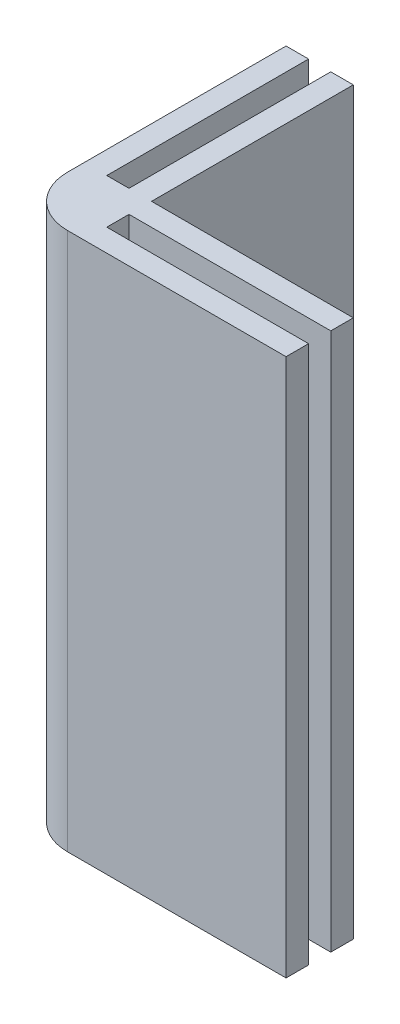
ISO-10303-21;
HEADER;
FILE_DESCRIPTION(('STEP AP214'),'2;1');
FILE_NAME('part.step','',(''),(''),'','','');
FILE_SCHEMA(('AUTOMOTIVE_DESIGN { 1 0 10303 214 1 1 1 1 }'));
ENDSEC;
DATA;
#1=APPLICATION_CONTEXT('core data for automotive mechanical design processes');
#2=APPLICATION_PROTOCOL_DEFINITION('international standard','automotive_design',2000,#1);
#3=PRODUCT_CONTEXT('',#1,'mechanical');
#4=PRODUCT('Part','Part','',(#3));
#5=PRODUCT_RELATED_PRODUCT_CATEGORY('part','',(#4));
#6=PRODUCT_DEFINITION_FORMATION('','',#4);
#7=PRODUCT_DEFINITION_CONTEXT('part definition',#1,'design');
#8=PRODUCT_DEFINITION('design','',#6,#7);
#9=PRODUCT_DEFINITION_SHAPE('','',#8);
#10=(LENGTH_UNIT() NAMED_UNIT(*) SI_UNIT(.MILLI.,.METRE.));
#11=(NAMED_UNIT(*) PLANE_ANGLE_UNIT() SI_UNIT($,.RADIAN.));
#12=(NAMED_UNIT(*) SI_UNIT($,.STERADIAN.) SOLID_ANGLE_UNIT());
#13=UNCERTAINTY_MEASURE_WITH_UNIT(LENGTH_MEASURE(1.E-05),#10,'distance_accuracy_value','');
#14=(GEOMETRIC_REPRESENTATION_CONTEXT(3) GLOBAL_UNCERTAINTY_ASSIGNED_CONTEXT((#13)) GLOBAL_UNIT_ASSIGNED_CONTEXT((#10,
#11,#12)) REPRESENTATION_CONTEXT('',''));
#15=CARTESIAN_POINT('',(0.,0.,0.));
#16=DIRECTION('',(0.,0.,1.));
#17=DIRECTION('',(1.,0.,0.));
#18=AXIS2_PLACEMENT_3D('',#15,#16,#17);
#19=CARTESIAN_POINT('',(0.,80.,-6.65));
#20=DIRECTION('',(0.,0.,1.));
#21=DIRECTION('',(1.,0.,0.));
#22=AXIS2_PLACEMENT_3D('',#19,#20,#21);
#23=PLANE('',#22);
#24=DIRECTION('',(-1.,0.,0.));
#25=VECTOR('',#24,1.);
#26=CARTESIAN_POINT('',(0.,0.,-6.65));
#27=LINE('',#26,#25);
#28=CARTESIAN_POINT('',(40.,0.,-6.65));
#29=VERTEX_POINT('',#28);
#30=CARTESIAN_POINT('',(10.,0.,-6.65));
#31=VERTEX_POINT('',#30);
#32=EDGE_CURVE('E145',#29,#31,#27,.T.);
#33=ORIENTED_EDGE('',*,*,#32,.F.);
#34=DIRECTION('',(0.,-1.,0.));
#35=VECTOR('',#34,1.);
#36=CARTESIAN_POINT('',(40.,80.,-6.65));
#37=LINE('',#36,#35);
#38=CARTESIAN_POINT('',(40.,80.,-6.65));
#39=VERTEX_POINT('',#38);
#40=EDGE_CURVE('E140',#39,#29,#37,.T.);
#41=ORIENTED_EDGE('',*,*,#40,.F.);
#42=DIRECTION('',(-1.,0.,0.));
#43=VECTOR('',#42,1.);
#44=CARTESIAN_POINT('',(0.,80.,-6.65));
#45=LINE('',#44,#43);
#46=CARTESIAN_POINT('',(10.,80.,-6.65));
#47=VERTEX_POINT('',#46);
#48=EDGE_CURVE('E143',#39,#47,#45,.T.);
#49=ORIENTED_EDGE('',*,*,#48,.T.);
#50=DIRECTION('',(0.,-1.,0.));
#51=VECTOR('',#50,1.);
#52=CARTESIAN_POINT('',(10.,80.,-6.65));
#53=LINE('',#52,#51);
#54=EDGE_CURVE('E195',#47,#31,#53,.T.);
#55=ORIENTED_EDGE('',*,*,#54,.T.);
#56=EDGE_LOOP('',(#33,#41,#49,#55));
#57=FACE_BOUND('',#56,.T.);
#58=ADVANCED_FACE('F35',(#57),#23,.T.);
#59=CARTESIAN_POINT('',(40.,80.,0.));
#60=DIRECTION('',(-1.,0.,0.));
#61=DIRECTION('',(0.,0.,1.));
#62=AXIS2_PLACEMENT_3D('',#59,#60,#61);
#63=PLANE('',#62);
#64=DIRECTION('',(0.,0.,-1.));
#65=VECTOR('',#64,1.);
#66=CARTESIAN_POINT('',(40.,0.,0.));
#67=LINE('',#66,#65);
#68=CARTESIAN_POINT('',(40.,0.,-10.));
#69=VERTEX_POINT('',#68);
#70=EDGE_CURVE('E197',#29,#69,#67,.T.);
#71=ORIENTED_EDGE('',*,*,#70,.T.);
#72=DIRECTION('',(0.,-1.,0.));
#73=VECTOR('',#72,1.);
#74=CARTESIAN_POINT('',(40.,80.,-10.));
#75=LINE('',#74,#73);
#76=CARTESIAN_POINT('',(40.,80.,-10.));
#77=VERTEX_POINT('',#76);
#78=EDGE_CURVE('E150',#77,#69,#75,.T.);
#79=ORIENTED_EDGE('',*,*,#78,.F.);
#80=DIRECTION('',(0.,0.,-1.));
#81=VECTOR('',#80,1.);
#82=CARTESIAN_POINT('',(40.,80.,0.));
#83=LINE('',#82,#81);
#84=EDGE_CURVE('E153',#39,#77,#83,.T.);
#85=ORIENTED_EDGE('',*,*,#84,.F.);
#86=ORIENTED_EDGE('',*,*,#40,.T.);
#87=EDGE_LOOP('',(#71,#79,#85,#86));
#88=FACE_BOUND('',#87,.T.);
#89=ADVANCED_FACE('F154',(#88),#63,.F.);
#90=CARTESIAN_POINT('',(0.,80.,-10.));
#91=DIRECTION('',(0.,0.,-1.));
#92=DIRECTION('',(-1.,0.,0.));
#93=AXIS2_PLACEMENT_3D('',#90,#91,#92);
#94=PLANE('',#93);
#95=DIRECTION('',(1.,0.,0.));
#96=VECTOR('',#95,1.);
#97=CARTESIAN_POINT('',(0.,0.,-10.));
#98=LINE('',#97,#96);
#99=CARTESIAN_POINT('',(10.,0.,-10.));
#100=VERTEX_POINT('',#99);
#101=EDGE_CURVE('E199',#100,#69,#98,.T.);
#102=ORIENTED_EDGE('',*,*,#101,.F.);
#103=DIRECTION('',(0.,-1.,0.));
#104=VECTOR('',#103,1.);
#105=CARTESIAN_POINT('',(10.,80.,-10.));
#106=LINE('',#105,#104);
#107=CARTESIAN_POINT('',(10.,80.,-10.));
#108=VERTEX_POINT('',#107);
#109=EDGE_CURVE('E250',#108,#100,#106,.T.);
#110=ORIENTED_EDGE('',*,*,#109,.F.);
#111=DIRECTION('',(1.,0.,0.));
#112=VECTOR('',#111,1.);
#113=CARTESIAN_POINT('',(0.,80.,-10.));
#114=LINE('',#113,#112);
#115=EDGE_CURVE('E158',#108,#77,#114,.T.);
#116=ORIENTED_EDGE('',*,*,#115,.T.);
#117=ORIENTED_EDGE('',*,*,#78,.T.);
#118=EDGE_LOOP('',(#102,#110,#116,#117));
#119=FACE_BOUND('',#118,.T.);
#120=ADVANCED_FACE('F284',(#119),#94,.T.);
#121=CARTESIAN_POINT('',(10.,80.,0.));
#122=DIRECTION('',(-1.,0.,0.));
#123=DIRECTION('',(0.,0.,1.));
#124=AXIS2_PLACEMENT_3D('',#121,#122,#123);
#125=PLANE('',#124);
#126=DIRECTION('',(0.,0.,-1.));
#127=VECTOR('',#126,1.);
#128=CARTESIAN_POINT('',(10.,0.,0.));
#129=LINE('',#128,#127);
#130=CARTESIAN_POINT('',(10.,0.,-40.));
#131=VERTEX_POINT('',#130);
#132=EDGE_CURVE('E202',#100,#131,#129,.T.);
#133=ORIENTED_EDGE('',*,*,#132,.T.);
#134=DIRECTION('',(0.,-1.,0.));
#135=VECTOR('',#134,1.);
#136=CARTESIAN_POINT('',(10.,80.,-40.));
#137=LINE('',#136,#135);
#138=CARTESIAN_POINT('',(10.,80.,-40.));
#139=VERTEX_POINT('',#138);
#140=EDGE_CURVE('E248',#139,#131,#137,.T.);
#141=ORIENTED_EDGE('',*,*,#140,.F.);
#142=DIRECTION('',(0.,0.,-1.));
#143=VECTOR('',#142,1.);
#144=CARTESIAN_POINT('',(10.,80.,0.));
#145=LINE('',#144,#143);
#146=EDGE_CURVE('E171',#108,#139,#145,.T.);
#147=ORIENTED_EDGE('',*,*,#146,.F.);
#148=ORIENTED_EDGE('',*,*,#109,.T.);
#149=EDGE_LOOP('',(#133,#141,#147,#148));
#150=FACE_BOUND('',#149,.T.);
#151=ADVANCED_FACE('F289',(#150),#125,.F.);
#152=CARTESIAN_POINT('',(0.,80.,-40.));
#153=DIRECTION('',(0.,0.,-1.));
#154=DIRECTION('',(-1.,0.,0.));
#155=AXIS2_PLACEMENT_3D('',#152,#153,#154);
#156=PLANE('',#155);
#157=DIRECTION('',(1.,0.,0.));
#158=VECTOR('',#157,1.);
#159=CARTESIAN_POINT('',(0.,0.,-40.));
#160=LINE('',#159,#158);
#161=CARTESIAN_POINT('',(6.65,0.,-40.));
#162=VERTEX_POINT('',#161);
#163=EDGE_CURVE('E205',#162,#131,#160,.T.);
#164=ORIENTED_EDGE('',*,*,#163,.F.);
#165=DIRECTION('',(0.,-1.,0.));
#166=VECTOR('',#165,1.);
#167=CARTESIAN_POINT('',(6.65,80.,-40.));
#168=LINE('',#167,#166);
#169=CARTESIAN_POINT('',(6.65,80.,-40.));
#170=VERTEX_POINT('',#169);
#171=EDGE_CURVE('E246',#170,#162,#168,.T.);
#172=ORIENTED_EDGE('',*,*,#171,.F.);
#173=DIRECTION('',(1.,0.,0.));
#174=VECTOR('',#173,1.);
#175=CARTESIAN_POINT('',(0.,80.,-40.));
#176=LINE('',#175,#174);
#177=EDGE_CURVE('E173',#170,#139,#176,.T.);
#178=ORIENTED_EDGE('',*,*,#177,.T.);
#179=ORIENTED_EDGE('',*,*,#140,.T.);
#180=EDGE_LOOP('',(#164,#172,#178,#179));
#181=FACE_BOUND('',#180,.T.);
#182=ADVANCED_FACE('F293',(#181),#156,.T.);
#183=CARTESIAN_POINT('',(6.65,80.,0.));
#184=DIRECTION('',(1.,0.,0.));
#185=DIRECTION('',(0.,0.,-1.));
#186=AXIS2_PLACEMENT_3D('',#183,#184,#185);
#187=PLANE('',#186);
#188=DIRECTION('',(0.,0.,1.));
#189=VECTOR('',#188,1.);
#190=CARTESIAN_POINT('',(6.65,0.,0.));
#191=LINE('',#190,#189);
#192=CARTESIAN_POINT('',(6.65,0.,-10.));
#193=VERTEX_POINT('',#192);
#194=EDGE_CURVE('E208',#162,#193,#191,.T.);
#195=ORIENTED_EDGE('',*,*,#194,.T.);
#196=DIRECTION('',(0.,-1.,0.));
#197=VECTOR('',#196,1.);
#198=CARTESIAN_POINT('',(6.65,80.,-10.));
#199=LINE('',#198,#197);
#200=CARTESIAN_POINT('',(6.65,80.,-10.));
#201=VERTEX_POINT('',#200);
#202=EDGE_CURVE('E244',#201,#193,#199,.T.);
#203=ORIENTED_EDGE('',*,*,#202,.F.);
#204=DIRECTION('',(0.,0.,1.));
#205=VECTOR('',#204,1.);
#206=CARTESIAN_POINT('',(6.65,80.,0.));
#207=LINE('',#206,#205);
#208=EDGE_CURVE('E176',#170,#201,#207,.T.);
#209=ORIENTED_EDGE('',*,*,#208,.F.);
#210=ORIENTED_EDGE('',*,*,#171,.T.);
#211=EDGE_LOOP('',(#195,#203,#209,#210));
#212=FACE_BOUND('',#211,.T.);
#213=ADVANCED_FACE('F297',(#212),#187,.F.);
#214=CARTESIAN_POINT('',(0.,80.,-10.));
#215=DIRECTION('',(0.,0.,-1.));
#216=DIRECTION('',(-1.,0.,0.));
#217=AXIS2_PLACEMENT_3D('',#214,#215,#216);
#218=PLANE('',#217);
#219=DIRECTION('',(1.,0.,0.));
#220=VECTOR('',#219,1.);
#221=CARTESIAN_POINT('',(0.,0.,-10.));
#222=LINE('',#221,#220);
#223=CARTESIAN_POINT('',(3.35,0.,-10.));
#224=VERTEX_POINT('',#223);
#225=EDGE_CURVE('E211',#224,#193,#222,.T.);
#226=ORIENTED_EDGE('',*,*,#225,.F.);
#227=DIRECTION('',(0.,-1.,0.));
#228=VECTOR('',#227,1.);
#229=CARTESIAN_POINT('',(3.35,80.,-10.));
#230=LINE('',#229,#228);
#231=CARTESIAN_POINT('',(3.35,80.,-10.));
#232=VERTEX_POINT('',#231);
#233=EDGE_CURVE('E242',#232,#224,#230,.T.);
#234=ORIENTED_EDGE('',*,*,#233,.F.);
#235=DIRECTION('',(1.,0.,0.));
#236=VECTOR('',#235,1.);
#237=CARTESIAN_POINT('',(0.,80.,-10.));
#238=LINE('',#237,#236);
#239=EDGE_CURVE('E178',#232,#201,#238,.T.);
#240=ORIENTED_EDGE('',*,*,#239,.T.);
#241=ORIENTED_EDGE('',*,*,#202,.T.);
#242=EDGE_LOOP('',(#226,#234,#240,#241));
#243=FACE_BOUND('',#242,.T.);
#244=ADVANCED_FACE('F301',(#243),#218,.T.);
#245=CARTESIAN_POINT('',(3.35,80.,0.));
#246=DIRECTION('',(-1.,0.,0.));
#247=DIRECTION('',(0.,0.,1.));
#248=AXIS2_PLACEMENT_3D('',#245,#246,#247);
#249=PLANE('',#248);
#250=DIRECTION('',(0.,0.,-1.));
#251=VECTOR('',#250,1.);
#252=CARTESIAN_POINT('',(3.35,0.,0.));
#253=LINE('',#252,#251);
#254=CARTESIAN_POINT('',(3.35,0.,-40.));
#255=VERTEX_POINT('',#254);
#256=EDGE_CURVE('E214',#224,#255,#253,.T.);
#257=ORIENTED_EDGE('',*,*,#256,.T.);
#258=DIRECTION('',(0.,-1.,0.));
#259=VECTOR('',#258,1.);
#260=CARTESIAN_POINT('',(3.35,80.,-40.));
#261=LINE('',#260,#259);
#262=CARTESIAN_POINT('',(3.35,80.,-40.));
#263=VERTEX_POINT('',#262);
#264=EDGE_CURVE('E240',#263,#255,#261,.T.);
#265=ORIENTED_EDGE('',*,*,#264,.F.);
#266=DIRECTION('',(0.,0.,-1.));
#267=VECTOR('',#266,1.);
#268=CARTESIAN_POINT('',(3.35,80.,0.));
#269=LINE('',#268,#267);
#270=EDGE_CURVE('E181',#232,#263,#269,.T.);
#271=ORIENTED_EDGE('',*,*,#270,.F.);
#272=ORIENTED_EDGE('',*,*,#233,.T.);
#273=EDGE_LOOP('',(#257,#265,#271,#272));
#274=FACE_BOUND('',#273,.T.);
#275=ADVANCED_FACE('F305',(#274),#249,.F.);
#276=CARTESIAN_POINT('',(0.,80.,-40.));
#277=DIRECTION('',(0.,0.,-1.));
#278=DIRECTION('',(-1.,0.,0.));
#279=AXIS2_PLACEMENT_3D('',#276,#277,#278);
#280=PLANE('',#279);
#281=DIRECTION('',(1.,0.,0.));
#282=VECTOR('',#281,1.);
#283=CARTESIAN_POINT('',(0.,0.,-40.));
#284=LINE('',#283,#282);
#285=CARTESIAN_POINT('',(0.,0.,-40.));
#286=VERTEX_POINT('',#285);
#287=EDGE_CURVE('E217',#286,#255,#284,.T.);
#288=ORIENTED_EDGE('',*,*,#287,.F.);
#289=DIRECTION('',(0.,-1.,0.));
#290=VECTOR('',#289,1.);
#291=CARTESIAN_POINT('',(0.,80.,-40.));
#292=LINE('',#291,#290);
#293=CARTESIAN_POINT('',(0.,80.,-40.));
#294=VERTEX_POINT('',#293);
#295=EDGE_CURVE('E237',#294,#286,#292,.T.);
#296=ORIENTED_EDGE('',*,*,#295,.F.);
#297=DIRECTION('',(1.,0.,0.));
#298=VECTOR('',#297,1.);
#299=CARTESIAN_POINT('',(0.,80.,-40.));
#300=LINE('',#299,#298);
#301=EDGE_CURVE('E183',#294,#263,#300,.T.);
#302=ORIENTED_EDGE('',*,*,#301,.T.);
#303=ORIENTED_EDGE('',*,*,#264,.T.);
#304=EDGE_LOOP('',(#288,#296,#302,#303));
#305=FACE_BOUND('',#304,.T.);
#306=ADVANCED_FACE('F309',(#305),#280,.T.);
#307=CARTESIAN_POINT('',(0.,80.,0.));
#308=DIRECTION('',(-1.,0.,0.));
#309=DIRECTION('',(0.,0.,1.));
#310=AXIS2_PLACEMENT_3D('',#307,#308,#309);
#311=PLANE('',#310);
#312=DIRECTION('',(0.,0.,-1.));
#313=VECTOR('',#312,1.);
#314=CARTESIAN_POINT('',(0.,0.,0.));
#315=LINE('',#314,#313);
#316=CARTESIAN_POINT('',(0.,0.,-7.5));
#317=VERTEX_POINT('',#316);
#318=EDGE_CURVE('E220',#317,#286,#315,.T.);
#319=ORIENTED_EDGE('',*,*,#318,.F.);
#320=DIRECTION('',(0.,-1.,0.));
#321=VECTOR('',#320,1.);
#322=CARTESIAN_POINT('',(0.,80.,-7.5));
#323=LINE('',#322,#321);
#324=CARTESIAN_POINT('',(0.,80.,-7.5));
#325=VERTEX_POINT('',#324);
#326=EDGE_CURVE('E43',#317,#325,#323,.F.);
#327=ORIENTED_EDGE('',*,*,#326,.T.);
#328=DIRECTION('',(0.,0.,-1.));
#329=VECTOR('',#328,1.);
#330=CARTESIAN_POINT('',(0.,80.,0.));
#331=LINE('',#330,#329);
#332=EDGE_CURVE('E186',#325,#294,#331,.T.);
#333=ORIENTED_EDGE('',*,*,#332,.T.);
#334=ORIENTED_EDGE('',*,*,#295,.T.);
#335=EDGE_LOOP('',(#319,#327,#333,#334));
#336=FACE_BOUND('',#335,.T.);
#337=ADVANCED_FACE('F313',(#336),#311,.T.);
#338=CARTESIAN_POINT('',(0.,80.,0.));
#339=DIRECTION('',(0.,0.,-1.));
#340=DIRECTION('',(-1.,0.,0.));
#341=AXIS2_PLACEMENT_3D('',#338,#339,#340);
#342=PLANE('',#341);
#343=DIRECTION('',(1.,0.,0.));
#344=VECTOR('',#343,1.);
#345=CARTESIAN_POINT('',(0.,80.,0.));
#346=LINE('',#345,#344);
#347=CARTESIAN_POINT('',(7.5,80.,0.));
#348=VERTEX_POINT('',#347);
#349=CARTESIAN_POINT('',(40.,80.,0.));
#350=VERTEX_POINT('',#349);
#351=EDGE_CURVE('E188',#348,#350,#346,.T.);
#352=ORIENTED_EDGE('',*,*,#351,.F.);
#353=DIRECTION('',(0.,-1.,0.));
#354=VECTOR('',#353,1.);
#355=CARTESIAN_POINT('',(7.5,0.,0.));
#356=LINE('',#355,#354);
#357=CARTESIAN_POINT('',(7.5,0.,0.));
#358=VERTEX_POINT('',#357);
#359=EDGE_CURVE('E149',#348,#358,#356,.T.);
#360=ORIENTED_EDGE('',*,*,#359,.T.);
#361=DIRECTION('',(1.,0.,0.));
#362=VECTOR('',#361,1.);
#363=CARTESIAN_POINT('',(0.,0.,0.));
#364=LINE('',#363,#362);
#365=CARTESIAN_POINT('',(40.,0.,0.));
#366=VERTEX_POINT('',#365);
#367=EDGE_CURVE('E222',#358,#366,#364,.T.);
#368=ORIENTED_EDGE('',*,*,#367,.T.);
#369=DIRECTION('',(0.,-1.,0.));
#370=VECTOR('',#369,1.);
#371=CARTESIAN_POINT('',(40.,80.,0.));
#372=LINE('',#371,#370);
#373=EDGE_CURVE('E234',#350,#366,#372,.T.);
#374=ORIENTED_EDGE('',*,*,#373,.F.);
#375=EDGE_LOOP('',(#352,#360,#368,#374));
#376=FACE_BOUND('',#375,.T.);
#377=ADVANCED_FACE('F258',(#376),#342,.F.);
#378=CARTESIAN_POINT('',(40.,80.,0.));
#379=DIRECTION('',(-1.,0.,0.));
#380=DIRECTION('',(0.,0.,1.));
#381=AXIS2_PLACEMENT_3D('',#378,#379,#380);
#382=PLANE('',#381);
#383=DIRECTION('',(0.,0.,-1.));
#384=VECTOR('',#383,1.);
#385=CARTESIAN_POINT('',(40.,0.,0.));
#386=LINE('',#385,#384);
#387=CARTESIAN_POINT('',(40.,0.,-3.35));
#388=VERTEX_POINT('',#387);
#389=EDGE_CURVE('E224',#366,#388,#386,.T.);
#390=ORIENTED_EDGE('',*,*,#389,.T.);
#391=DIRECTION('',(0.,-1.,0.));
#392=VECTOR('',#391,1.);
#393=CARTESIAN_POINT('',(40.,80.,-3.35));
#394=LINE('',#393,#392);
#395=CARTESIAN_POINT('',(40.,80.,-3.35));
#396=VERTEX_POINT('',#395);
#397=EDGE_CURVE('E231',#396,#388,#394,.T.);
#398=ORIENTED_EDGE('',*,*,#397,.F.);
#399=DIRECTION('',(0.,0.,-1.));
#400=VECTOR('',#399,1.);
#401=CARTESIAN_POINT('',(40.,80.,0.));
#402=LINE('',#401,#400);
#403=EDGE_CURVE('E190',#350,#396,#402,.T.);
#404=ORIENTED_EDGE('',*,*,#403,.F.);
#405=ORIENTED_EDGE('',*,*,#373,.T.);
#406=EDGE_LOOP('',(#390,#398,#404,#405));
#407=FACE_BOUND('',#406,.T.);
#408=ADVANCED_FACE('F268',(#407),#382,.F.);
#409=CARTESIAN_POINT('',(0.,80.,-3.35));
#410=DIRECTION('',(0.,0.,1.));
#411=DIRECTION('',(1.,0.,0.));
#412=AXIS2_PLACEMENT_3D('',#409,#410,#411);
#413=PLANE('',#412);
#414=DIRECTION('',(-1.,0.,0.));
#415=VECTOR('',#414,1.);
#416=CARTESIAN_POINT('',(0.,0.,-3.35));
#417=LINE('',#416,#415);
#418=CARTESIAN_POINT('',(10.,0.,-3.35));
#419=VERTEX_POINT('',#418);
#420=EDGE_CURVE('E167',#388,#419,#417,.T.);
#421=ORIENTED_EDGE('',*,*,#420,.T.);
#422=DIRECTION('',(0.,-1.,0.));
#423=VECTOR('',#422,1.);
#424=CARTESIAN_POINT('',(10.,80.,-3.35));
#425=LINE('',#424,#423);
#426=CARTESIAN_POINT('',(10.,80.,-3.35));
#427=VERTEX_POINT('',#426);
#428=EDGE_CURVE('E228',#427,#419,#425,.T.);
#429=ORIENTED_EDGE('',*,*,#428,.F.);
#430=DIRECTION('',(-1.,0.,0.));
#431=VECTOR('',#430,1.);
#432=CARTESIAN_POINT('',(0.,80.,-3.35));
#433=LINE('',#432,#431);
#434=EDGE_CURVE('E192',#396,#427,#433,.T.);
#435=ORIENTED_EDGE('',*,*,#434,.F.);
#436=ORIENTED_EDGE('',*,*,#397,.T.);
#437=EDGE_LOOP('',(#421,#429,#435,#436));
#438=FACE_BOUND('',#437,.T.);
#439=ADVANCED_FACE('F272',(#438),#413,.F.);
#440=CARTESIAN_POINT('',(10.,80.,0.));
#441=DIRECTION('',(-1.,0.,0.));
#442=DIRECTION('',(0.,0.,1.));
#443=AXIS2_PLACEMENT_3D('',#440,#441,#442);
#444=PLANE('',#443);
#445=DIRECTION('',(0.,0.,-1.));
#446=VECTOR('',#445,1.);
#447=CARTESIAN_POINT('',(10.,0.,0.));
#448=LINE('',#447,#446);
#449=EDGE_CURVE('E164',#419,#31,#448,.T.);
#450=ORIENTED_EDGE('',*,*,#449,.T.);
#451=ORIENTED_EDGE('',*,*,#54,.F.);
#452=DIRECTION('',(0.,0.,-1.));
#453=VECTOR('',#452,1.);
#454=CARTESIAN_POINT('',(10.,80.,0.));
#455=LINE('',#454,#453);
#456=EDGE_CURVE('E162',#427,#47,#455,.T.);
#457=ORIENTED_EDGE('',*,*,#456,.F.);
#458=ORIENTED_EDGE('',*,*,#428,.T.);
#459=EDGE_LOOP('',(#450,#451,#457,#458));
#460=FACE_BOUND('',#459,.T.);
#461=ADVANCED_FACE('F323',(#460),#444,.F.);
#462=CARTESIAN_POINT('',(0.,80.,0.));
#463=DIRECTION('',(0.,1.,0.));
#464=DIRECTION('',(0.,0.,1.));
#465=AXIS2_PLACEMENT_3D('',#462,#463,#464);
#466=PLANE('',#465);
#467=ORIENTED_EDGE('',*,*,#332,.F.);
#468=CARTESIAN_POINT('',(7.5,80.,-7.5));
#469=DIRECTION('',(0.,1.,0.));
#470=DIRECTION('',(0.,0.,1.));
#471=AXIS2_PLACEMENT_3D('',#468,#469,#470);
#472=CIRCLE('',#471,7.5);
#473=EDGE_CURVE('E11',#325,#348,#472,.T.);
#474=ORIENTED_EDGE('',*,*,#473,.T.);
#475=ORIENTED_EDGE('',*,*,#351,.T.);
#476=ORIENTED_EDGE('',*,*,#403,.T.);
#477=ORIENTED_EDGE('',*,*,#434,.T.);
#478=ORIENTED_EDGE('',*,*,#456,.T.);
#479=ORIENTED_EDGE('',*,*,#48,.F.);
#480=ORIENTED_EDGE('',*,*,#84,.T.);
#481=ORIENTED_EDGE('',*,*,#115,.F.);
#482=ORIENTED_EDGE('',*,*,#146,.T.);
#483=ORIENTED_EDGE('',*,*,#177,.F.);
#484=ORIENTED_EDGE('',*,*,#208,.T.);
#485=ORIENTED_EDGE('',*,*,#239,.F.);
#486=ORIENTED_EDGE('',*,*,#270,.T.);
#487=ORIENTED_EDGE('',*,*,#301,.F.);
#488=EDGE_LOOP('',(#467,#474,#475,#476,#477,#478,#479,#480,#481,#482,#483,#484,#485,#486,#487));
#489=FACE_BOUND('',#488,.T.);
#490=ADVANCED_FACE('F160',(#489),#466,.T.);
#491=CARTESIAN_POINT('',(0.,0.,0.));
#492=DIRECTION('',(0.,1.,0.));
#493=DIRECTION('',(0.,0.,1.));
#494=AXIS2_PLACEMENT_3D('',#491,#492,#493);
#495=PLANE('',#494);
#496=ORIENTED_EDGE('',*,*,#367,.F.);
#497=CARTESIAN_POINT('',(7.5,0.,-7.5));
#498=DIRECTION('',(0.,1.,0.));
#499=DIRECTION('',(0.,0.,1.));
#500=AXIS2_PLACEMENT_3D('',#497,#498,#499);
#501=CIRCLE('',#500,7.5);
#502=EDGE_CURVE('E57',#358,#317,#501,.F.);
#503=ORIENTED_EDGE('',*,*,#502,.T.);
#504=ORIENTED_EDGE('',*,*,#318,.T.);
#505=ORIENTED_EDGE('',*,*,#287,.T.);
#506=ORIENTED_EDGE('',*,*,#256,.F.);
#507=ORIENTED_EDGE('',*,*,#225,.T.);
#508=ORIENTED_EDGE('',*,*,#194,.F.);
#509=ORIENTED_EDGE('',*,*,#163,.T.);
#510=ORIENTED_EDGE('',*,*,#132,.F.);
#511=ORIENTED_EDGE('',*,*,#101,.T.);
#512=ORIENTED_EDGE('',*,*,#70,.F.);
#513=ORIENTED_EDGE('',*,*,#32,.T.);
#514=ORIENTED_EDGE('',*,*,#449,.F.);
#515=ORIENTED_EDGE('',*,*,#420,.F.);
#516=ORIENTED_EDGE('',*,*,#389,.F.);
#517=EDGE_LOOP('',(#496,#503,#504,#505,#506,#507,#508,#509,#510,#511,#512,#513,#514,#515,#516));
#518=FACE_BOUND('',#517,.T.);
#519=ADVANCED_FACE('F263',(#518),#495,.F.);
#520=CARTESIAN_POINT('',(7.5,80.,-7.5));
#521=DIRECTION('',(0.,1.,0.));
#522=DIRECTION('',(0.,0.,1.));
#523=AXIS2_PLACEMENT_3D('',#520,#521,#522);
#524=CYLINDRICAL_SURFACE('',#523,7.5);
#525=ORIENTED_EDGE('',*,*,#473,.F.);
#526=ORIENTED_EDGE('',*,*,#326,.F.);
#527=ORIENTED_EDGE('',*,*,#502,.F.);
#528=ORIENTED_EDGE('',*,*,#359,.F.);
#529=EDGE_LOOP('',(#525,#526,#527,#528));
#530=FACE_BOUND('',#529,.T.);
#531=ADVANCED_FACE('F37',(#530),#524,.T.);
#532=CLOSED_SHELL('',(#58,#89,#120,#151,#182,#213,#244,#275,#306,#337,#377,#408,#439,#461,#490,
#519,#531));
#533=MANIFOLD_SOLID_BREP('B2',#532);
#534=ADVANCED_BREP_SHAPE_REPRESENTATION('',(#18,#533),#14);
#535=SHAPE_DEFINITION_REPRESENTATION(#9,#534);
ENDSEC;
END-ISO-10303-21;
